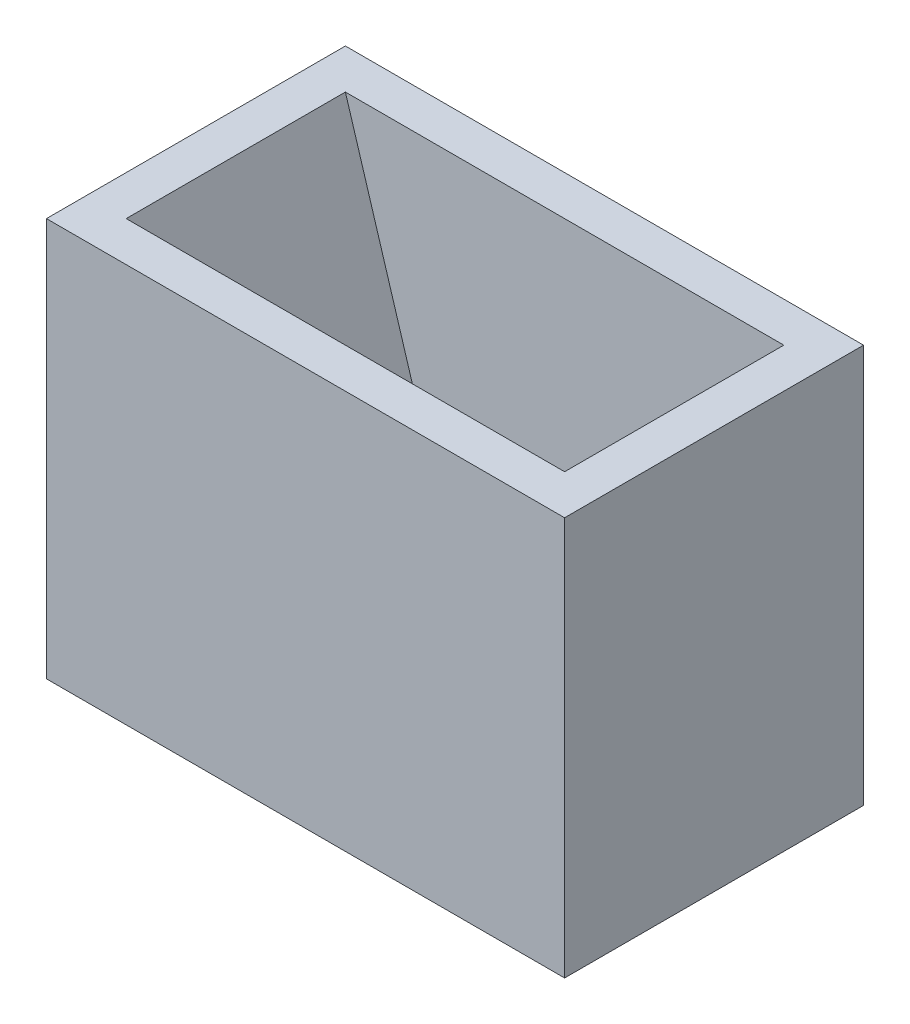
ISO-10303-21;
HEADER;
FILE_DESCRIPTION(('STEP AP214'),'2;1');
FILE_NAME('part.step','',(''),(''),'','','');
FILE_SCHEMA(('AUTOMOTIVE_DESIGN { 1 0 10303 214 1 1 1 1 }'));
ENDSEC;
DATA;
#1=APPLICATION_CONTEXT('core data for automotive mechanical design processes');
#2=APPLICATION_PROTOCOL_DEFINITION('international standard','automotive_design',2000,#1);
#3=PRODUCT_CONTEXT('',#1,'mechanical');
#4=PRODUCT('Part','Part','',(#3));
#5=PRODUCT_RELATED_PRODUCT_CATEGORY('part','',(#4));
#6=PRODUCT_DEFINITION_FORMATION('','',#4);
#7=PRODUCT_DEFINITION_CONTEXT('part definition',#1,'design');
#8=PRODUCT_DEFINITION('design','',#6,#7);
#9=PRODUCT_DEFINITION_SHAPE('','',#8);
#10=(LENGTH_UNIT() NAMED_UNIT(*) SI_UNIT(.MILLI.,.METRE.));
#11=(NAMED_UNIT(*) PLANE_ANGLE_UNIT() SI_UNIT($,.RADIAN.));
#12=(NAMED_UNIT(*) SI_UNIT($,.STERADIAN.) SOLID_ANGLE_UNIT());
#13=UNCERTAINTY_MEASURE_WITH_UNIT(LENGTH_MEASURE(1.E-05),#10,'distance_accuracy_value','');
#14=(GEOMETRIC_REPRESENTATION_CONTEXT(3) GLOBAL_UNCERTAINTY_ASSIGNED_CONTEXT((#13)) GLOBAL_UNIT_ASSIGNED_CONTEXT((#10,
#11,#12)) REPRESENTATION_CONTEXT('',''));
#15=CARTESIAN_POINT('',(0.,0.,0.));
#16=DIRECTION('',(0.,0.,1.));
#17=DIRECTION('',(1.,0.,0.));
#18=AXIS2_PLACEMENT_3D('',#15,#16,#17);
#19=CARTESIAN_POINT('',(-5.5,10.,-2.75));
#20=DIRECTION('',(0.,0.,1.));
#21=DIRECTION('',(1.,0.,0.));
#22=AXIS2_PLACEMENT_3D('',#19,#20,#21);
#23=PLANE('',#22);
#24=DIRECTION('',(1.,0.,0.));
#25=VECTOR('',#24,1.);
#26=CARTESIAN_POINT('',(-5.5,0.999999999999999,-2.75));
#27=LINE('',#26,#25);
#28=CARTESIAN_POINT('',(0.,1.,-2.75));
#29=VERTEX_POINT('',#28);
#30=CARTESIAN_POINT('',(2.75,0.999999999999999,-2.75));
#31=VERTEX_POINT('',#30);
#32=EDGE_CURVE('E148',#29,#31,#27,.T.);
#33=ORIENTED_EDGE('',*,*,#32,.T.);
#34=DIRECTION('',(0.29221853559902,0.956351571051339,0.));
#35=VECTOR('',#34,1.);
#36=CARTESIAN_POINT('',(4.56069160197601,6.92589978828511,-2.75));
#37=LINE('',#36,#35);
#38=CARTESIAN_POINT('',(5.5,10.,-2.75));
#39=VERTEX_POINT('',#38);
#40=EDGE_CURVE('E126',#31,#39,#37,.T.);
#41=ORIENTED_EDGE('',*,*,#40,.T.);
#42=DIRECTION('',(-1.,0.,0.));
#43=VECTOR('',#42,1.);
#44=CARTESIAN_POINT('',(-5.5,10.,-2.75));
#45=LINE('',#44,#43);
#46=CARTESIAN_POINT('',(-5.5,10.,-2.75));
#47=VERTEX_POINT('',#46);
#48=EDGE_CURVE('E151',#39,#47,#45,.T.);
#49=ORIENTED_EDGE('',*,*,#48,.T.);
#50=DIRECTION('',(0.29221853559902,-0.956351571051339,0.));
#51=VECTOR('',#50,1.);
#52=CARTESIAN_POINT('',(-5.5,10.,-2.75));
#53=LINE('',#52,#51);
#54=CARTESIAN_POINT('',(-2.75,1.,-2.75));
#55=VERTEX_POINT('',#54);
#56=EDGE_CURVE('E135',#47,#55,#53,.T.);
#57=ORIENTED_EDGE('',*,*,#56,.T.);
#58=EDGE_CURVE('E141',#55,#29,#27,.T.);
#59=ORIENTED_EDGE('',*,*,#58,.T.);
#60=EDGE_LOOP('',(#33,#41,#49,#57,#59));
#61=FACE_BOUND('',#60,.T.);
#62=ADVANCED_FACE('F33',(#61),#23,.T.);
#63=CARTESIAN_POINT('',(-5.5,10.,2.75));
#64=DIRECTION('',(0.,0.,-1.));
#65=DIRECTION('',(-1.,0.,0.));
#66=AXIS2_PLACEMENT_3D('',#63,#64,#65);
#67=PLANE('',#66);
#68=DIRECTION('',(1.,0.,0.));
#69=VECTOR('',#68,1.);
#70=CARTESIAN_POINT('',(-5.5,10.,2.75));
#71=LINE('',#70,#69);
#72=CARTESIAN_POINT('',(-5.5,10.,2.75));
#73=VERTEX_POINT('',#72);
#74=CARTESIAN_POINT('',(5.5,10.,2.75));
#75=VERTEX_POINT('',#74);
#76=EDGE_CURVE('E122',#73,#75,#71,.T.);
#77=ORIENTED_EDGE('',*,*,#76,.T.);
#78=DIRECTION('',(-0.29221853559902,-0.956351571051339,0.));
#79=VECTOR('',#78,1.);
#80=CARTESIAN_POINT('',(4.56069160197601,6.92589978828511,2.75));
#81=LINE('',#80,#79);
#82=CARTESIAN_POINT('',(2.75,1.,2.75));
#83=VERTEX_POINT('',#82);
#84=EDGE_CURVE('E119',#75,#83,#81,.T.);
#85=ORIENTED_EDGE('',*,*,#84,.T.);
#86=DIRECTION('',(-1.,0.,0.));
#87=VECTOR('',#86,1.);
#88=CARTESIAN_POINT('',(-5.5,0.999999999999999,2.75));
#89=LINE('',#88,#87);
#90=CARTESIAN_POINT('',(0.,1.,2.75));
#91=VERTEX_POINT('',#90);
#92=EDGE_CURVE('E110',#83,#91,#89,.T.);
#93=ORIENTED_EDGE('',*,*,#92,.T.);
#94=CARTESIAN_POINT('',(-2.75,0.999999999999999,2.75));
#95=VERTEX_POINT('',#94);
#96=EDGE_CURVE('E117',#91,#95,#89,.T.);
#97=ORIENTED_EDGE('',*,*,#96,.T.);
#98=DIRECTION('',(-0.29221853559902,0.956351571051339,0.));
#99=VECTOR('',#98,1.);
#100=CARTESIAN_POINT('',(-5.5,10.,2.75));
#101=LINE('',#100,#99);
#102=EDGE_CURVE('E133',#95,#73,#101,.T.);
#103=ORIENTED_EDGE('',*,*,#102,.T.);
#104=EDGE_LOOP('',(#77,#85,#93,#97,#103));
#105=FACE_BOUND('',#104,.T.);
#106=ADVANCED_FACE('F120',(#105),#67,.T.);
#107=CARTESIAN_POINT('',(0.,1.,0.));
#108=DIRECTION('',(0.,-1.,0.));
#109=DIRECTION('',(0.,0.,-1.));
#110=AXIS2_PLACEMENT_3D('',#107,#108,#109);
#111=PLANE('',#110);
#112=DIRECTION('',(0.,0.,-1.));
#113=VECTOR('',#112,1.);
#114=CARTESIAN_POINT('',(2.75,1.,3.));
#115=LINE('',#114,#113);
#116=CARTESIAN_POINT('',(2.75,1.,0.));
#117=VERTEX_POINT('',#116);
#118=EDGE_CURVE('E48',#117,#31,#115,.T.);
#119=ORIENTED_EDGE('',*,*,#118,.T.);
#120=ORIENTED_EDGE('',*,*,#32,.F.);
#121=CARTESIAN_POINT('',(0.,1.,0.));
#122=DIRECTION('',(0.,-1.,0.));
#123=DIRECTION('',(0.,0.,-1.));
#124=AXIS2_PLACEMENT_3D('',#121,#122,#123);
#125=CIRCLE('',#124,2.75);
#126=EDGE_CURVE('E139',#29,#117,#125,.T.);
#127=ORIENTED_EDGE('',*,*,#126,.T.);
#128=EDGE_LOOP('',(#119,#120,#127));
#129=FACE_BOUND('',#128,.T.);
#130=ADVANCED_FACE('F200',(#129),#111,.F.);
#131=EDGE_CURVE('E56',#83,#117,#115,.T.);
#132=ORIENTED_EDGE('',*,*,#131,.T.);
#133=EDGE_CURVE('E113',#117,#91,#125,.T.);
#134=ORIENTED_EDGE('',*,*,#133,.T.);
#135=ORIENTED_EDGE('',*,*,#92,.F.);
#136=EDGE_LOOP('',(#132,#134,#135));
#137=FACE_BOUND('',#136,.T.);
#138=ADVANCED_FACE('F112',(#137),#111,.F.);
#139=DIRECTION('',(0.,0.,-1.));
#140=VECTOR('',#139,1.);
#141=CARTESIAN_POINT('',(-2.75,1.,0.));
#142=LINE('',#141,#140);
#143=CARTESIAN_POINT('',(-2.75,1.,0.));
#144=VERTEX_POINT('',#143);
#145=EDGE_CURVE('E11',#95,#144,#142,.T.);
#146=ORIENTED_EDGE('',*,*,#145,.F.);
#147=ORIENTED_EDGE('',*,*,#96,.F.);
#148=EDGE_CURVE('E142',#91,#144,#125,.T.);
#149=ORIENTED_EDGE('',*,*,#148,.T.);
#150=EDGE_LOOP('',(#146,#147,#149));
#151=FACE_BOUND('',#150,.T.);
#152=ADVANCED_FACE('F207',(#151),#111,.F.);
#153=EDGE_CURVE('E37',#144,#55,#142,.T.);
#154=ORIENTED_EDGE('',*,*,#153,.F.);
#155=EDGE_CURVE('E145',#144,#29,#125,.T.);
#156=ORIENTED_EDGE('',*,*,#155,.T.);
#157=ORIENTED_EDGE('',*,*,#58,.F.);
#158=EDGE_LOOP('',(#154,#156,#157));
#159=FACE_BOUND('',#158,.T.);
#160=ADVANCED_FACE('F205',(#159),#111,.F.);
#161=CARTESIAN_POINT('',(0.,10.,0.));
#162=DIRECTION('',(0.,1.,0.));
#163=DIRECTION('',(0.,0.,1.));
#164=AXIS2_PLACEMENT_3D('',#161,#162,#163);
#165=PLANE('',#164);
#166=DIRECTION('',(0.,0.,-1.));
#167=VECTOR('',#166,1.);
#168=CARTESIAN_POINT('',(5.5,10.,-2.75));
#169=LINE('',#168,#167);
#170=EDGE_CURVE('E149',#75,#39,#169,.T.);
#171=ORIENTED_EDGE('',*,*,#170,.F.);
#172=ORIENTED_EDGE('',*,*,#76,.F.);
#173=DIRECTION('',(0.,0.,1.));
#174=VECTOR('',#173,1.);
#175=CARTESIAN_POINT('',(-5.5,10.,-2.75));
#176=LINE('',#175,#174);
#177=EDGE_CURVE('E153',#47,#73,#176,.T.);
#178=ORIENTED_EDGE('',*,*,#177,.F.);
#179=ORIENTED_EDGE('',*,*,#48,.F.);
#180=EDGE_LOOP('',(#171,#172,#178,#179));
#181=FACE_BOUND('',#180,.T.);
#182=DIRECTION('',(0.,0.,1.));
#183=VECTOR('',#182,1.);
#184=CARTESIAN_POINT('',(-6.5,10.,-3.75));
#185=LINE('',#184,#183);
#186=CARTESIAN_POINT('',(-6.5,10.,-3.75));
#187=VERTEX_POINT('',#186);
#188=CARTESIAN_POINT('',(-6.5,10.,3.75));
#189=VERTEX_POINT('',#188);
#190=EDGE_CURVE('E158',#187,#189,#185,.T.);
#191=ORIENTED_EDGE('',*,*,#190,.T.);
#192=DIRECTION('',(1.,0.,0.));
#193=VECTOR('',#192,1.);
#194=CARTESIAN_POINT('',(-6.5,10.,3.75));
#195=LINE('',#194,#193);
#196=CARTESIAN_POINT('',(6.5,10.,3.75));
#197=VERTEX_POINT('',#196);
#198=EDGE_CURVE('E161',#189,#197,#195,.T.);
#199=ORIENTED_EDGE('',*,*,#198,.T.);
#200=DIRECTION('',(0.,0.,-1.));
#201=VECTOR('',#200,1.);
#202=CARTESIAN_POINT('',(6.5,10.,-3.75));
#203=LINE('',#202,#201);
#204=CARTESIAN_POINT('',(6.5,10.,-3.75));
#205=VERTEX_POINT('',#204);
#206=EDGE_CURVE('E164',#197,#205,#203,.T.);
#207=ORIENTED_EDGE('',*,*,#206,.T.);
#208=DIRECTION('',(-1.,0.,0.));
#209=VECTOR('',#208,1.);
#210=CARTESIAN_POINT('',(-6.5,10.,-3.75));
#211=LINE('',#210,#209);
#212=EDGE_CURVE('E166',#205,#187,#211,.T.);
#213=ORIENTED_EDGE('',*,*,#212,.T.);
#214=EDGE_LOOP('',(#191,#199,#207,#213));
#215=FACE_BOUND('',#214,.T.);
#216=ADVANCED_FACE('F196',(#181,#215),#165,.T.);
#217=CARTESIAN_POINT('',(0.,0.,0.));
#218=DIRECTION('',(0.,1.,0.));
#219=DIRECTION('',(0.,0.,1.));
#220=AXIS2_PLACEMENT_3D('',#217,#218,#219);
#221=PLANE('',#220);
#222=CARTESIAN_POINT('',(0.,0.,0.));
#223=DIRECTION('',(0.,-1.,0.));
#224=DIRECTION('',(0.,0.,-1.));
#225=AXIS2_PLACEMENT_3D('',#222,#223,#224);
#226=CIRCLE('',#225,2.75);
#227=CARTESIAN_POINT('',(0.,0.,-2.75));
#228=VERTEX_POINT('',#227);
#229=EDGE_CURVE('E138',#228,#228,#226,.T.);
#230=ORIENTED_EDGE('',*,*,#229,.F.);
#231=EDGE_LOOP('',(#230));
#232=FACE_BOUND('',#231,.T.);
#233=DIRECTION('',(0.,0.,1.));
#234=VECTOR('',#233,1.);
#235=CARTESIAN_POINT('',(-6.5,0.,-3.75));
#236=LINE('',#235,#234);
#237=CARTESIAN_POINT('',(-6.5,0.,-3.75));
#238=VERTEX_POINT('',#237);
#239=CARTESIAN_POINT('',(-6.5,0.,3.75));
#240=VERTEX_POINT('',#239);
#241=EDGE_CURVE('E157',#238,#240,#236,.T.);
#242=ORIENTED_EDGE('',*,*,#241,.F.);
#243=DIRECTION('',(-1.,0.,0.));
#244=VECTOR('',#243,1.);
#245=CARTESIAN_POINT('',(-6.5,0.,-3.75));
#246=LINE('',#245,#244);
#247=CARTESIAN_POINT('',(6.5,0.,-3.75));
#248=VERTEX_POINT('',#247);
#249=EDGE_CURVE('E162',#248,#238,#246,.T.);
#250=ORIENTED_EDGE('',*,*,#249,.F.);
#251=DIRECTION('',(0.,0.,-1.));
#252=VECTOR('',#251,1.);
#253=CARTESIAN_POINT('',(6.5,0.,-3.75));
#254=LINE('',#253,#252);
#255=CARTESIAN_POINT('',(6.5,0.,3.75));
#256=VERTEX_POINT('',#255);
#257=EDGE_CURVE('E174',#256,#248,#254,.T.);
#258=ORIENTED_EDGE('',*,*,#257,.F.);
#259=DIRECTION('',(1.,0.,0.));
#260=VECTOR('',#259,1.);
#261=CARTESIAN_POINT('',(-6.5,0.,3.75));
#262=LINE('',#261,#260);
#263=EDGE_CURVE('E171',#240,#256,#262,.T.);
#264=ORIENTED_EDGE('',*,*,#263,.F.);
#265=EDGE_LOOP('',(#242,#250,#258,#264));
#266=FACE_BOUND('',#265,.T.);
#267=ADVANCED_FACE('F213',(#232,#266),#221,.F.);
#268=CARTESIAN_POINT('',(-6.5,10.,-3.75));
#269=DIRECTION('',(1.,0.,0.));
#270=DIRECTION('',(0.,0.,-1.));
#271=AXIS2_PLACEMENT_3D('',#268,#269,#270);
#272=PLANE('',#271);
#273=ORIENTED_EDGE('',*,*,#241,.T.);
#274=DIRECTION('',(0.,-1.,0.));
#275=VECTOR('',#274,1.);
#276=CARTESIAN_POINT('',(-6.5,10.,3.75));
#277=LINE('',#276,#275);
#278=EDGE_CURVE('E184',#189,#240,#277,.T.);
#279=ORIENTED_EDGE('',*,*,#278,.F.);
#280=ORIENTED_EDGE('',*,*,#190,.F.);
#281=DIRECTION('',(0.,-1.,0.));
#282=VECTOR('',#281,1.);
#283=CARTESIAN_POINT('',(-6.5,10.,-3.75));
#284=LINE('',#283,#282);
#285=EDGE_CURVE('E168',#187,#238,#284,.T.);
#286=ORIENTED_EDGE('',*,*,#285,.T.);
#287=EDGE_LOOP('',(#273,#279,#280,#286));
#288=FACE_BOUND('',#287,.T.);
#289=ADVANCED_FACE('F35',(#288),#272,.F.);
#290=CARTESIAN_POINT('',(-6.5,10.,3.75));
#291=DIRECTION('',(0.,0.,-1.));
#292=DIRECTION('',(-1.,0.,0.));
#293=AXIS2_PLACEMENT_3D('',#290,#291,#292);
#294=PLANE('',#293);
#295=ORIENTED_EDGE('',*,*,#263,.T.);
#296=DIRECTION('',(0.,-1.,0.));
#297=VECTOR('',#296,1.);
#298=CARTESIAN_POINT('',(6.5,10.,3.75));
#299=LINE('',#298,#297);
#300=EDGE_CURVE('E182',#197,#256,#299,.T.);
#301=ORIENTED_EDGE('',*,*,#300,.F.);
#302=ORIENTED_EDGE('',*,*,#198,.F.);
#303=ORIENTED_EDGE('',*,*,#278,.T.);
#304=EDGE_LOOP('',(#295,#301,#302,#303));
#305=FACE_BOUND('',#304,.T.);
#306=ADVANCED_FACE('F233',(#305),#294,.F.);
#307=CARTESIAN_POINT('',(6.5,10.,-3.75));
#308=DIRECTION('',(-1.,0.,0.));
#309=DIRECTION('',(0.,0.,1.));
#310=AXIS2_PLACEMENT_3D('',#307,#308,#309);
#311=PLANE('',#310);
#312=ORIENTED_EDGE('',*,*,#257,.T.);
#313=DIRECTION('',(0.,-1.,0.));
#314=VECTOR('',#313,1.);
#315=CARTESIAN_POINT('',(6.5,10.,-3.75));
#316=LINE('',#315,#314);
#317=EDGE_CURVE('E180',#205,#248,#316,.T.);
#318=ORIENTED_EDGE('',*,*,#317,.F.);
#319=ORIENTED_EDGE('',*,*,#206,.F.);
#320=ORIENTED_EDGE('',*,*,#300,.T.);
#321=EDGE_LOOP('',(#312,#318,#319,#320));
#322=FACE_BOUND('',#321,.T.);
#323=ADVANCED_FACE('F230',(#322),#311,.F.);
#324=CARTESIAN_POINT('',(-6.5,10.,-3.75));
#325=DIRECTION('',(0.,0.,1.));
#326=DIRECTION('',(1.,0.,0.));
#327=AXIS2_PLACEMENT_3D('',#324,#325,#326);
#328=PLANE('',#327);
#329=ORIENTED_EDGE('',*,*,#249,.T.);
#330=ORIENTED_EDGE('',*,*,#285,.F.);
#331=ORIENTED_EDGE('',*,*,#212,.F.);
#332=ORIENTED_EDGE('',*,*,#317,.T.);
#333=EDGE_LOOP('',(#329,#330,#331,#332));
#334=FACE_BOUND('',#333,.T.);
#335=ADVANCED_FACE('F227',(#334),#328,.F.);
#336=CARTESIAN_POINT('',(0.,1.,0.));
#337=DIRECTION('',(0.,-1.,0.));
#338=DIRECTION('',(0.,0.,-1.));
#339=AXIS2_PLACEMENT_3D('',#336,#337,#338);
#340=CYLINDRICAL_SURFACE('',#339,2.75);
#341=ORIENTED_EDGE('',*,*,#229,.T.);
#342=EDGE_LOOP('',(#341));
#343=FACE_BOUND('',#342,.T.);
#344=ORIENTED_EDGE('',*,*,#126,.F.);
#345=ORIENTED_EDGE('',*,*,#155,.F.);
#346=ORIENTED_EDGE('',*,*,#148,.F.);
#347=ORIENTED_EDGE('',*,*,#133,.F.);
#348=EDGE_LOOP('',(#344,#345,#346,#347));
#349=FACE_BOUND('',#348,.T.);
#350=ADVANCED_FACE('F203',(#343,#349),#340,.F.);
#351=CARTESIAN_POINT('',(-5.5,10.,3.));
#352=DIRECTION('',(-0.956351571051339,-0.29221853559902,0.));
#353=DIRECTION('',(0.29221853559902,-0.956351571051339,0.));
#354=AXIS2_PLACEMENT_3D('',#351,#352,#353);
#355=PLANE('',#354);
#356=ORIENTED_EDGE('',*,*,#56,.F.);
#357=ORIENTED_EDGE('',*,*,#177,.T.);
#358=ORIENTED_EDGE('',*,*,#102,.F.);
#359=ORIENTED_EDGE('',*,*,#145,.T.);
#360=ORIENTED_EDGE('',*,*,#153,.T.);
#361=EDGE_LOOP('',(#356,#357,#358,#359,#360));
#362=FACE_BOUND('',#361,.T.);
#363=ADVANCED_FACE('F191',(#362),#355,.F.);
#364=CARTESIAN_POINT('',(5.5,10.,3.));
#365=DIRECTION('',(0.956351571051339,-0.29221853559902,0.));
#366=DIRECTION('',(0.29221853559902,0.956351571051339,0.));
#367=AXIS2_PLACEMENT_3D('',#364,#365,#366);
#368=PLANE('',#367);
#369=ORIENTED_EDGE('',*,*,#40,.F.);
#370=ORIENTED_EDGE('',*,*,#118,.F.);
#371=ORIENTED_EDGE('',*,*,#131,.F.);
#372=ORIENTED_EDGE('',*,*,#84,.F.);
#373=ORIENTED_EDGE('',*,*,#170,.T.);
#374=EDGE_LOOP('',(#369,#370,#371,#372,#373));
#375=FACE_BOUND('',#374,.T.);
#376=ADVANCED_FACE('F129',(#375),#368,.F.);
#377=CLOSED_SHELL('',(#62,#106,#130,#138,#152,#160,#216,#267,#289,#306,#323,#335,#350,#363,#376));
#378=MANIFOLD_SOLID_BREP('B2',#377);
#379=ADVANCED_BREP_SHAPE_REPRESENTATION('',(#18,#378),#14);
#380=SHAPE_DEFINITION_REPRESENTATION(#9,#379);
ENDSEC;
END-ISO-10303-21;
